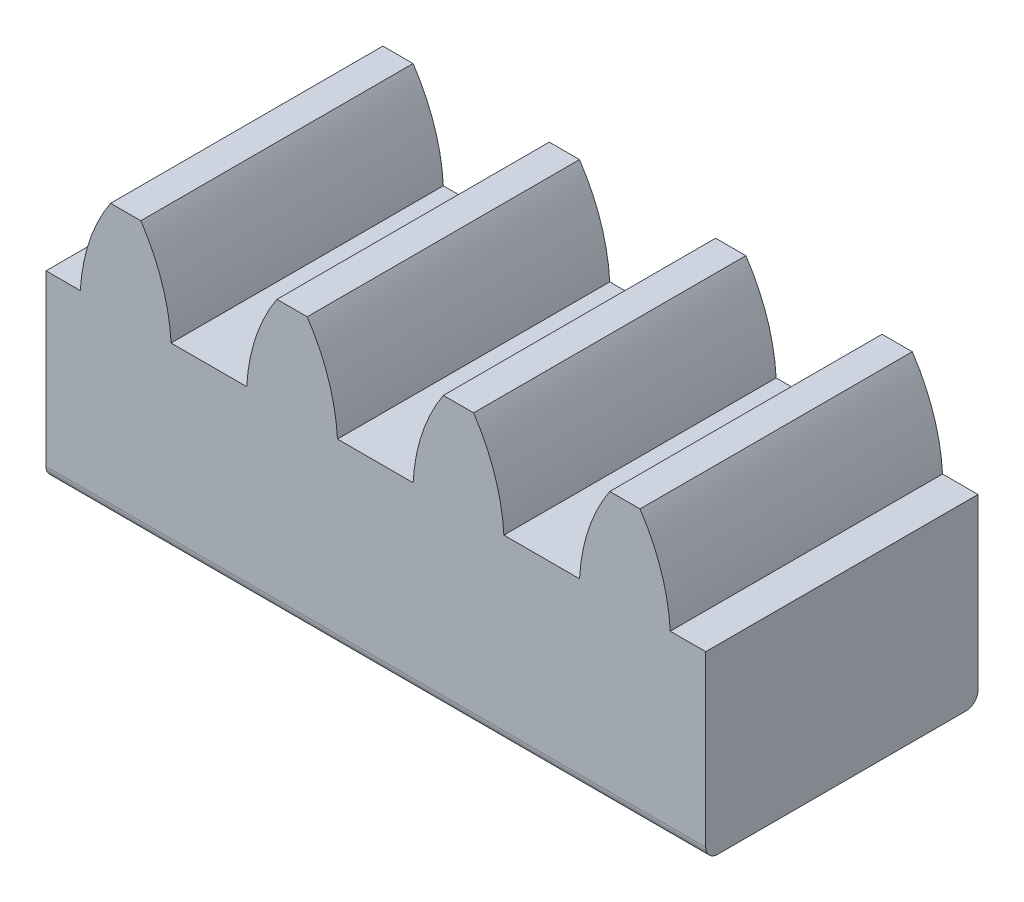
ISO-10303-21;
HEADER;
FILE_DESCRIPTION(('STEP AP214'),'2;1');
FILE_NAME('part.step','',(''),(''),'','','');
FILE_SCHEMA(('AUTOMOTIVE_DESIGN { 1 0 10303 214 1 1 1 1 }'));
ENDSEC;
DATA;
#1=APPLICATION_CONTEXT('core data for automotive mechanical design processes');
#2=APPLICATION_PROTOCOL_DEFINITION('international standard','automotive_design',2000,#1);
#3=PRODUCT_CONTEXT('',#1,'mechanical');
#4=PRODUCT('Part','Part','',(#3));
#5=PRODUCT_RELATED_PRODUCT_CATEGORY('part','',(#4));
#6=PRODUCT_DEFINITION_FORMATION('','',#4);
#7=PRODUCT_DEFINITION_CONTEXT('part definition',#1,'design');
#8=PRODUCT_DEFINITION('design','',#6,#7);
#9=PRODUCT_DEFINITION_SHAPE('','',#8);
#10=(LENGTH_UNIT() NAMED_UNIT(*) SI_UNIT(.MILLI.,.METRE.));
#11=(NAMED_UNIT(*) PLANE_ANGLE_UNIT() SI_UNIT($,.RADIAN.));
#12=(NAMED_UNIT(*) SI_UNIT($,.STERADIAN.) SOLID_ANGLE_UNIT());
#13=UNCERTAINTY_MEASURE_WITH_UNIT(LENGTH_MEASURE(1.E-05),#10,'distance_accuracy_value','');
#14=(GEOMETRIC_REPRESENTATION_CONTEXT(3) GLOBAL_UNCERTAINTY_ASSIGNED_CONTEXT((#13)) GLOBAL_UNIT_ASSIGNED_CONTEXT((#10,
#11,#12)) REPRESENTATION_CONTEXT('',''));
#15=CARTESIAN_POINT('',(0.,0.,0.));
#16=DIRECTION('',(0.,0.,1.));
#17=DIRECTION('',(1.,0.,0.));
#18=AXIS2_PLACEMENT_3D('',#15,#16,#17);
#19=CARTESIAN_POINT('',(-43.831629358462,-35.1596046715852,-13.2426406871193));
#20=DIRECTION('',(0.,0.,1.));
#21=DIRECTION('',(1.,0.,0.));
#22=AXIS2_PLACEMENT_3D('',#19,#20,#21);
#23=CYLINDRICAL_SURFACE('',#22,6.);
#24=CARTESIAN_POINT('',(-43.831629358462,-35.1596046715852,-9.00000000000001));
#25=DIRECTION('',(0.,0.,1.));
#26=DIRECTION('',(1.,0.,0.));
#27=AXIS2_PLACEMENT_3D('',#24,#25,#26);
#28=CIRCLE('',#27,6.);
#29=CARTESIAN_POINT('',(-38.840727793145,-31.8293041498129,-9.00000000000001));
#30=VERTEX_POINT('',#29);
#31=CARTESIAN_POINT('',(-37.840727793145,-34.8293041498129,-9.00000000000001));
#32=VERTEX_POINT('',#31);
#33=EDGE_CURVE('E213',#30,#32,#28,.F.);
#34=ORIENTED_EDGE('',*,*,#33,.F.);
#35=DIRECTION('',(0.,0.,1.));
#36=VECTOR('',#35,1.);
#37=CARTESIAN_POINT('',(-38.840727793145,-31.8293041498129,-13.2426406871193));
#38=LINE('',#37,#36);
#39=CARTESIAN_POINT('',(-38.840727793145,-31.8293041498129,0.));
#40=VERTEX_POINT('',#39);
#41=EDGE_CURVE('E207',#30,#40,#38,.T.);
#42=ORIENTED_EDGE('',*,*,#41,.T.);
#43=CARTESIAN_POINT('',(-43.831629358462,-35.1596046715852,0.));
#44=DIRECTION('',(0.,0.,1.));
#45=DIRECTION('',(1.,0.,0.));
#46=AXIS2_PLACEMENT_3D('',#43,#44,#45);
#47=CIRCLE('',#46,6.);
#48=CARTESIAN_POINT('',(-37.840727793145,-34.8293041498129,0.));
#49=VERTEX_POINT('',#48);
#50=EDGE_CURVE('E211',#49,#40,#47,.T.);
#51=ORIENTED_EDGE('',*,*,#50,.F.);
#52=DIRECTION('',(0.,0.,1.));
#53=VECTOR('',#52,1.);
#54=CARTESIAN_POINT('',(-37.840727793145,-34.8293041498129,-13.2426406871193));
#55=LINE('',#54,#53);
#56=EDGE_CURVE('E379',#32,#49,#55,.T.);
#57=ORIENTED_EDGE('',*,*,#56,.F.);
#58=EDGE_LOOP('',(#34,#42,#51,#57));
#59=FACE_BOUND('',#58,.T.);
#60=ADVANCED_FACE('F57',(#59),#23,.T.);
#61=CARTESIAN_POINT('',(16.5,-31.8293041498129,-13.2426406871193));
#62=DIRECTION('',(0.,-1.,0.));
#63=DIRECTION('',(0.,0.,-1.));
#64=AXIS2_PLACEMENT_3D('',#61,#62,#63);
#65=PLANE('',#64);
#66=ORIENTED_EDGE('',*,*,#41,.F.);
#67=DIRECTION('',(-1.,0.,0.));
#68=VECTOR('',#67,1.);
#69=CARTESIAN_POINT('',(16.5,-31.8293041498129,-9.00000000000001));
#70=LINE('',#69,#68);
#71=CARTESIAN_POINT('',(-39.840727793145,-31.8293041498129,-9.00000000000001));
#72=VERTEX_POINT('',#71);
#73=EDGE_CURVE('E216',#30,#72,#70,.T.);
#74=ORIENTED_EDGE('',*,*,#73,.T.);
#75=DIRECTION('',(0.,0.,1.));
#76=VECTOR('',#75,1.);
#77=CARTESIAN_POINT('',(-39.840727793145,-31.8293041498129,-13.2426406871193));
#78=LINE('',#77,#76);
#79=CARTESIAN_POINT('',(-39.840727793145,-31.8293041498129,0.));
#80=VERTEX_POINT('',#79);
#81=EDGE_CURVE('E222',#72,#80,#78,.T.);
#82=ORIENTED_EDGE('',*,*,#81,.T.);
#83=DIRECTION('',(1.,0.,0.));
#84=VECTOR('',#83,1.);
#85=CARTESIAN_POINT('',(16.5,-31.8293041498129,0.));
#86=LINE('',#85,#84);
#87=EDGE_CURVE('E219',#80,#40,#86,.T.);
#88=ORIENTED_EDGE('',*,*,#87,.T.);
#89=EDGE_LOOP('',(#66,#74,#82,#88));
#90=FACE_BOUND('',#89,.T.);
#91=ADVANCED_FACE('F220',(#90),#65,.F.);
#92=CARTESIAN_POINT('',(-34.8498262278281,-35.1596046715852,-13.2426406871193));
#93=DIRECTION('',(0.,0.,1.));
#94=DIRECTION('',(1.,0.,0.));
#95=AXIS2_PLACEMENT_3D('',#92,#93,#94);
#96=CYLINDRICAL_SURFACE('',#95,6.);
#97=ORIENTED_EDGE('',*,*,#81,.F.);
#98=CARTESIAN_POINT('',(-34.8498262278281,-35.1596046715852,-9.00000000000001));
#99=DIRECTION('',(0.,0.,1.));
#100=DIRECTION('',(1.,0.,0.));
#101=AXIS2_PLACEMENT_3D('',#98,#99,#100);
#102=CIRCLE('',#101,6.);
#103=CARTESIAN_POINT('',(-40.840727793145,-34.8293041498129,-9.00000000000001));
#104=VERTEX_POINT('',#103);
#105=EDGE_CURVE('E226',#72,#104,#102,.T.);
#106=ORIENTED_EDGE('',*,*,#105,.T.);
#107=DIRECTION('',(0.,0.,1.));
#108=VECTOR('',#107,1.);
#109=CARTESIAN_POINT('',(-40.840727793145,-34.8293041498129,-13.2426406871193));
#110=LINE('',#109,#108);
#111=CARTESIAN_POINT('',(-40.840727793145,-34.8293041498129,0.));
#112=VERTEX_POINT('',#111);
#113=EDGE_CURVE('E246',#104,#112,#110,.T.);
#114=ORIENTED_EDGE('',*,*,#113,.T.);
#115=CARTESIAN_POINT('',(-34.8498262278281,-35.1596046715852,0.));
#116=DIRECTION('',(0.,0.,1.));
#117=DIRECTION('',(1.,0.,0.));
#118=AXIS2_PLACEMENT_3D('',#115,#116,#117);
#119=CIRCLE('',#118,6.);
#120=EDGE_CURVE('E383',#112,#80,#119,.F.);
#121=ORIENTED_EDGE('',*,*,#120,.T.);
#122=EDGE_LOOP('',(#97,#106,#114,#121));
#123=FACE_BOUND('',#122,.T.);
#124=ADVANCED_FACE('F411',(#123),#96,.T.);
#125=CARTESIAN_POINT('',(0.,-34.8293041498129,-239.07824755939));
#126=DIRECTION('',(0.,-1.,0.));
#127=DIRECTION('',(0.,0.,-1.));
#128=AXIS2_PLACEMENT_3D('',#125,#126,#127);
#129=PLANE('',#128);
#130=ORIENTED_EDGE('',*,*,#113,.F.);
#131=DIRECTION('',(-1.,0.,0.));
#132=VECTOR('',#131,1.);
#133=CARTESIAN_POINT('',(0.,-34.8293041498129,-9.00000000000001));
#134=LINE('',#133,#132);
#135=CARTESIAN_POINT('',(-43.340727793145,-34.8293041498129,-9.00000000000001));
#136=VERTEX_POINT('',#135);
#137=EDGE_CURVE('E358',#104,#136,#134,.T.);
#138=ORIENTED_EDGE('',*,*,#137,.T.);
#139=DIRECTION('',(0.,0.,1.));
#140=VECTOR('',#139,1.);
#141=CARTESIAN_POINT('',(-43.340727793145,-34.8293041498129,-13.2426406871193));
#142=LINE('',#141,#140);
#143=CARTESIAN_POINT('',(-43.340727793145,-34.8293041498129,0.));
#144=VERTEX_POINT('',#143);
#145=EDGE_CURVE('E355',#136,#144,#142,.T.);
#146=ORIENTED_EDGE('',*,*,#145,.T.);
#147=DIRECTION('',(1.,0.,0.));
#148=VECTOR('',#147,1.);
#149=CARTESIAN_POINT('',(0.,-34.8293041498129,0.));
#150=LINE('',#149,#148);
#151=EDGE_CURVE('E357',#144,#112,#150,.T.);
#152=ORIENTED_EDGE('',*,*,#151,.T.);
#153=EDGE_LOOP('',(#130,#138,#146,#152));
#154=FACE_BOUND('',#153,.T.);
#155=ADVANCED_FACE('F430',(#154),#129,.F.);
#156=CARTESIAN_POINT('',(-49.331629358462,-35.1596046715852,-13.2426406871193));
#157=DIRECTION('',(0.,0.,1.));
#158=DIRECTION('',(1.,0.,0.));
#159=AXIS2_PLACEMENT_3D('',#156,#157,#158);
#160=CYLINDRICAL_SURFACE('',#159,6.);
#161=CARTESIAN_POINT('',(-49.331629358462,-35.1596046715852,-9.00000000000001));
#162=DIRECTION('',(0.,0.,1.));
#163=DIRECTION('',(1.,0.,0.));
#164=AXIS2_PLACEMENT_3D('',#161,#162,#163);
#165=CIRCLE('',#164,6.);
#166=CARTESIAN_POINT('',(-44.340727793145,-31.8293041498129,-9.00000000000001));
#167=VERTEX_POINT('',#166);
#168=EDGE_CURVE('E327',#167,#136,#165,.F.);
#169=ORIENTED_EDGE('',*,*,#168,.F.);
#170=DIRECTION('',(0.,0.,1.));
#171=VECTOR('',#170,1.);
#172=CARTESIAN_POINT('',(-44.340727793145,-31.8293041498129,-13.2426406871193));
#173=LINE('',#172,#171);
#174=CARTESIAN_POINT('',(-44.340727793145,-31.8293041498129,0.));
#175=VERTEX_POINT('',#174);
#176=EDGE_CURVE('E359',#167,#175,#173,.T.);
#177=ORIENTED_EDGE('',*,*,#176,.T.);
#178=CARTESIAN_POINT('',(-49.331629358462,-35.1596046715852,0.));
#179=DIRECTION('',(0.,0.,1.));
#180=DIRECTION('',(1.,0.,0.));
#181=AXIS2_PLACEMENT_3D('',#178,#179,#180);
#182=CIRCLE('',#181,6.);
#183=EDGE_CURVE('E234',#144,#175,#182,.T.);
#184=ORIENTED_EDGE('',*,*,#183,.F.);
#185=ORIENTED_EDGE('',*,*,#145,.F.);
#186=EDGE_LOOP('',(#169,#177,#184,#185));
#187=FACE_BOUND('',#186,.T.);
#188=ADVANCED_FACE('F417',(#187),#160,.T.);
#189=CARTESIAN_POINT('',(11.,-31.8293041498129,-13.2426406871193));
#190=DIRECTION('',(0.,-1.,0.));
#191=DIRECTION('',(0.,0.,-1.));
#192=AXIS2_PLACEMENT_3D('',#189,#190,#191);
#193=PLANE('',#192);
#194=ORIENTED_EDGE('',*,*,#176,.F.);
#195=DIRECTION('',(-1.,0.,0.));
#196=VECTOR('',#195,1.);
#197=CARTESIAN_POINT('',(11.,-31.8293041498129,-9.00000000000001));
#198=LINE('',#197,#196);
#199=CARTESIAN_POINT('',(-45.340727793145,-31.8293041498129,-9.00000000000001));
#200=VERTEX_POINT('',#199);
#201=EDGE_CURVE('E361',#167,#200,#198,.T.);
#202=ORIENTED_EDGE('',*,*,#201,.T.);
#203=DIRECTION('',(0.,0.,1.));
#204=VECTOR('',#203,1.);
#205=CARTESIAN_POINT('',(-45.340727793145,-31.8293041498129,-13.2426406871193));
#206=LINE('',#205,#204);
#207=CARTESIAN_POINT('',(-45.340727793145,-31.8293041498129,0.));
#208=VERTEX_POINT('',#207);
#209=EDGE_CURVE('E362',#200,#208,#206,.T.);
#210=ORIENTED_EDGE('',*,*,#209,.T.);
#211=DIRECTION('',(1.,0.,0.));
#212=VECTOR('',#211,1.);
#213=CARTESIAN_POINT('',(11.,-31.8293041498129,0.));
#214=LINE('',#213,#212);
#215=EDGE_CURVE('E364',#208,#175,#214,.T.);
#216=ORIENTED_EDGE('',*,*,#215,.T.);
#217=EDGE_LOOP('',(#194,#202,#210,#216));
#218=FACE_BOUND('',#217,.T.);
#219=ADVANCED_FACE('F420',(#218),#193,.F.);
#220=CARTESIAN_POINT('',(-40.3498262278281,-35.1596046715852,-13.2426406871193));
#221=DIRECTION('',(0.,0.,1.));
#222=DIRECTION('',(1.,0.,0.));
#223=AXIS2_PLACEMENT_3D('',#220,#221,#222);
#224=CYLINDRICAL_SURFACE('',#223,6.);
#225=ORIENTED_EDGE('',*,*,#209,.F.);
#226=CARTESIAN_POINT('',(-40.3498262278281,-35.1596046715852,-9.00000000000001));
#227=DIRECTION('',(0.,0.,1.));
#228=DIRECTION('',(1.,0.,0.));
#229=AXIS2_PLACEMENT_3D('',#226,#227,#228);
#230=CIRCLE('',#229,6.);
#231=CARTESIAN_POINT('',(-46.340727793145,-34.8293041498129,-9.00000000000001));
#232=VERTEX_POINT('',#231);
#233=EDGE_CURVE('E369',#200,#232,#230,.T.);
#234=ORIENTED_EDGE('',*,*,#233,.T.);
#235=DIRECTION('',(0.,0.,1.));
#236=VECTOR('',#235,1.);
#237=CARTESIAN_POINT('',(-46.340727793145,-34.8293041498129,-13.2426406871193));
#238=LINE('',#237,#236);
#239=CARTESIAN_POINT('',(-46.340727793145,-34.8293041498129,0.));
#240=VERTEX_POINT('',#239);
#241=EDGE_CURVE('E365',#232,#240,#238,.T.);
#242=ORIENTED_EDGE('',*,*,#241,.T.);
#243=CARTESIAN_POINT('',(-40.3498262278281,-35.1596046715852,0.));
#244=DIRECTION('',(0.,0.,1.));
#245=DIRECTION('',(1.,0.,0.));
#246=AXIS2_PLACEMENT_3D('',#243,#244,#245);
#247=CIRCLE('',#246,6.);
#248=EDGE_CURVE('E368',#240,#208,#247,.F.);
#249=ORIENTED_EDGE('',*,*,#248,.T.);
#250=EDGE_LOOP('',(#225,#234,#242,#249));
#251=FACE_BOUND('',#250,.T.);
#252=ADVANCED_FACE('F425',(#251),#224,.T.);
#253=ORIENTED_EDGE('',*,*,#241,.F.);
#254=CARTESIAN_POINT('',(-48.840727793145,-34.8293041498129,-9.00000000000001));
#255=VERTEX_POINT('',#254);
#256=EDGE_CURVE('E331',#232,#255,#134,.T.);
#257=ORIENTED_EDGE('',*,*,#256,.T.);
#258=DIRECTION('',(0.,0.,1.));
#259=VECTOR('',#258,1.);
#260=CARTESIAN_POINT('',(-48.840727793145,-34.8293041498129,-13.2426406871193));
#261=LINE('',#260,#259);
#262=CARTESIAN_POINT('',(-48.840727793145,-34.8293041498129,0.));
#263=VERTEX_POINT('',#262);
#264=EDGE_CURVE('E328',#255,#263,#261,.T.);
#265=ORIENTED_EDGE('',*,*,#264,.T.);
#266=EDGE_CURVE('E330',#263,#240,#150,.T.);
#267=ORIENTED_EDGE('',*,*,#266,.T.);
#268=EDGE_LOOP('',(#253,#257,#265,#267));
#269=FACE_BOUND('',#268,.T.);
#270=ADVANCED_FACE('F426',(#269),#129,.F.);
#271=CARTESIAN_POINT('',(-54.831629358462,-35.1596046715852,-13.2426406871193));
#272=DIRECTION('',(0.,0.,1.));
#273=DIRECTION('',(1.,0.,0.));
#274=AXIS2_PLACEMENT_3D('',#271,#272,#273);
#275=CYLINDRICAL_SURFACE('',#274,6.);
#276=CARTESIAN_POINT('',(-54.831629358462,-35.1596046715852,-9.00000000000001));
#277=DIRECTION('',(0.,0.,1.));
#278=DIRECTION('',(1.,0.,0.));
#279=AXIS2_PLACEMENT_3D('',#276,#277,#278);
#280=CIRCLE('',#279,6.);
#281=CARTESIAN_POINT('',(-49.840727793145,-31.8293041498129,-9.00000000000001));
#282=VERTEX_POINT('',#281);
#283=EDGE_CURVE('E298',#282,#255,#280,.F.);
#284=ORIENTED_EDGE('',*,*,#283,.F.);
#285=DIRECTION('',(0.,0.,1.));
#286=VECTOR('',#285,1.);
#287=CARTESIAN_POINT('',(-49.840727793145,-31.8293041498129,-13.2426406871193));
#288=LINE('',#287,#286);
#289=CARTESIAN_POINT('',(-49.840727793145,-31.8293041498129,0.));
#290=VERTEX_POINT('',#289);
#291=EDGE_CURVE('E332',#282,#290,#288,.T.);
#292=ORIENTED_EDGE('',*,*,#291,.T.);
#293=CARTESIAN_POINT('',(-54.831629358462,-35.1596046715852,0.));
#294=DIRECTION('',(0.,0.,1.));
#295=DIRECTION('',(1.,0.,0.));
#296=AXIS2_PLACEMENT_3D('',#293,#294,#295);
#297=CIRCLE('',#296,6.);
#298=EDGE_CURVE('E238',#263,#290,#297,.T.);
#299=ORIENTED_EDGE('',*,*,#298,.F.);
#300=ORIENTED_EDGE('',*,*,#264,.F.);
#301=EDGE_LOOP('',(#284,#292,#299,#300));
#302=FACE_BOUND('',#301,.T.);
#303=ADVANCED_FACE('F428',(#302),#275,.T.);
#304=CARTESIAN_POINT('',(5.5,-31.8293041498129,-13.2426406871193));
#305=DIRECTION('',(0.,-1.,0.));
#306=DIRECTION('',(0.,0.,-1.));
#307=AXIS2_PLACEMENT_3D('',#304,#305,#306);
#308=PLANE('',#307);
#309=ORIENTED_EDGE('',*,*,#291,.F.);
#310=DIRECTION('',(-1.,0.,0.));
#311=VECTOR('',#310,1.);
#312=CARTESIAN_POINT('',(5.5,-31.8293041498129,-9.00000000000001));
#313=LINE('',#312,#311);
#314=CARTESIAN_POINT('',(-50.840727793145,-31.8293041498129,-9.00000000000001));
#315=VERTEX_POINT('',#314);
#316=EDGE_CURVE('E334',#282,#315,#313,.T.);
#317=ORIENTED_EDGE('',*,*,#316,.T.);
#318=DIRECTION('',(0.,0.,1.));
#319=VECTOR('',#318,1.);
#320=CARTESIAN_POINT('',(-50.840727793145,-31.8293041498129,-13.2426406871193));
#321=LINE('',#320,#319);
#322=CARTESIAN_POINT('',(-50.840727793145,-31.8293041498129,0.));
#323=VERTEX_POINT('',#322);
#324=EDGE_CURVE('E335',#315,#323,#321,.T.);
#325=ORIENTED_EDGE('',*,*,#324,.T.);
#326=DIRECTION('',(1.,0.,0.));
#327=VECTOR('',#326,1.);
#328=CARTESIAN_POINT('',(5.5,-31.8293041498129,0.));
#329=LINE('',#328,#327);
#330=EDGE_CURVE('E337',#323,#290,#329,.T.);
#331=ORIENTED_EDGE('',*,*,#330,.T.);
#332=EDGE_LOOP('',(#309,#317,#325,#331));
#333=FACE_BOUND('',#332,.T.);
#334=ADVANCED_FACE('F435',(#333),#308,.F.);
#335=CARTESIAN_POINT('',(-45.8498262278281,-35.1596046715852,-13.2426406871193));
#336=DIRECTION('',(0.,0.,1.));
#337=DIRECTION('',(1.,0.,0.));
#338=AXIS2_PLACEMENT_3D('',#335,#336,#337);
#339=CYLINDRICAL_SURFACE('',#338,6.);
#340=ORIENTED_EDGE('',*,*,#324,.F.);
#341=CARTESIAN_POINT('',(-45.8498262278281,-35.1596046715852,-9.00000000000001));
#342=DIRECTION('',(0.,0.,1.));
#343=DIRECTION('',(1.,0.,0.));
#344=AXIS2_PLACEMENT_3D('',#341,#342,#343);
#345=CIRCLE('',#344,6.);
#346=CARTESIAN_POINT('',(-51.840727793145,-34.8293041498129,-9.00000000000001));
#347=VERTEX_POINT('',#346);
#348=EDGE_CURVE('E342',#315,#347,#345,.T.);
#349=ORIENTED_EDGE('',*,*,#348,.T.);
#350=DIRECTION('',(0.,0.,1.));
#351=VECTOR('',#350,1.);
#352=CARTESIAN_POINT('',(-51.840727793145,-34.8293041498129,-13.2426406871193));
#353=LINE('',#352,#351);
#354=CARTESIAN_POINT('',(-51.840727793145,-34.8293041498129,0.));
#355=VERTEX_POINT('',#354);
#356=EDGE_CURVE('E338',#347,#355,#353,.T.);
#357=ORIENTED_EDGE('',*,*,#356,.T.);
#358=CARTESIAN_POINT('',(-45.8498262278281,-35.1596046715852,0.));
#359=DIRECTION('',(0.,0.,1.));
#360=DIRECTION('',(1.,0.,0.));
#361=AXIS2_PLACEMENT_3D('',#358,#359,#360);
#362=CIRCLE('',#361,6.);
#363=EDGE_CURVE('E341',#355,#323,#362,.F.);
#364=ORIENTED_EDGE('',*,*,#363,.T.);
#365=EDGE_LOOP('',(#340,#349,#357,#364));
#366=FACE_BOUND('',#365,.T.);
#367=ADVANCED_FACE('F444',(#366),#339,.T.);
#368=ORIENTED_EDGE('',*,*,#356,.F.);
#369=CARTESIAN_POINT('',(-54.340727793145,-34.8293041498129,-9.00000000000001));
#370=VERTEX_POINT('',#369);
#371=EDGE_CURVE('E272',#347,#370,#134,.T.);
#372=ORIENTED_EDGE('',*,*,#371,.T.);
#373=DIRECTION('',(0.,0.,1.));
#374=VECTOR('',#373,1.);
#375=CARTESIAN_POINT('',(-54.340727793145,-34.8293041498129,-13.2426406871193));
#376=LINE('',#375,#374);
#377=CARTESIAN_POINT('',(-54.340727793145,-34.8293041498129,0.));
#378=VERTEX_POINT('',#377);
#379=EDGE_CURVE('E303',#370,#378,#376,.T.);
#380=ORIENTED_EDGE('',*,*,#379,.T.);
#381=EDGE_CURVE('E268',#378,#355,#150,.T.);
#382=ORIENTED_EDGE('',*,*,#381,.T.);
#383=EDGE_LOOP('',(#368,#372,#380,#382));
#384=FACE_BOUND('',#383,.T.);
#385=ADVANCED_FACE('F391',(#384),#129,.F.);
#386=CARTESIAN_POINT('',(-60.331629358462,-35.1596046715852,-13.2426406871193));
#387=DIRECTION('',(0.,0.,1.));
#388=DIRECTION('',(1.,0.,0.));
#389=AXIS2_PLACEMENT_3D('',#386,#387,#388);
#390=CYLINDRICAL_SURFACE('',#389,6.);
#391=CARTESIAN_POINT('',(-60.331629358462,-35.1596046715852,-9.00000000000001));
#392=DIRECTION('',(0.,0.,1.));
#393=DIRECTION('',(1.,0.,0.));
#394=AXIS2_PLACEMENT_3D('',#391,#392,#393);
#395=CIRCLE('',#394,6.);
#396=CARTESIAN_POINT('',(-55.340727793145,-31.8293041498129,-9.00000000000001));
#397=VERTEX_POINT('',#396);
#398=EDGE_CURVE('E295',#397,#370,#395,.F.);
#399=ORIENTED_EDGE('',*,*,#398,.F.);
#400=DIRECTION('',(0.,0.,1.));
#401=VECTOR('',#400,1.);
#402=CARTESIAN_POINT('',(-55.340727793145,-31.8293041498129,-13.2426406871193));
#403=LINE('',#402,#401);
#404=CARTESIAN_POINT('',(-55.340727793145,-31.8293041498129,0.));
#405=VERTEX_POINT('',#404);
#406=EDGE_CURVE('E305',#397,#405,#403,.T.);
#407=ORIENTED_EDGE('',*,*,#406,.T.);
#408=CARTESIAN_POINT('',(-60.331629358462,-35.1596046715852,0.));
#409=DIRECTION('',(0.,0.,1.));
#410=DIRECTION('',(1.,0.,0.));
#411=AXIS2_PLACEMENT_3D('',#408,#409,#410);
#412=CIRCLE('',#411,6.);
#413=EDGE_CURVE('E277',#378,#405,#412,.T.);
#414=ORIENTED_EDGE('',*,*,#413,.F.);
#415=ORIENTED_EDGE('',*,*,#379,.F.);
#416=EDGE_LOOP('',(#399,#407,#414,#415));
#417=FACE_BOUND('',#416,.T.);
#418=ADVANCED_FACE('F400',(#417),#390,.T.);
#419=CARTESIAN_POINT('',(0.,-31.8293041498129,-13.2426406871193));
#420=DIRECTION('',(0.,-1.,0.));
#421=DIRECTION('',(0.,0.,-1.));
#422=AXIS2_PLACEMENT_3D('',#419,#420,#421);
#423=PLANE('',#422);
#424=ORIENTED_EDGE('',*,*,#406,.F.);
#425=DIRECTION('',(-1.,0.,0.));
#426=VECTOR('',#425,1.);
#427=CARTESIAN_POINT('',(0.,-31.8293041498129,-9.00000000000001));
#428=LINE('',#427,#426);
#429=CARTESIAN_POINT('',(-56.340727793145,-31.8293041498129,-9.00000000000001));
#430=VERTEX_POINT('',#429);
#431=EDGE_CURVE('E307',#397,#430,#428,.T.);
#432=ORIENTED_EDGE('',*,*,#431,.T.);
#433=DIRECTION('',(0.,0.,1.));
#434=VECTOR('',#433,1.);
#435=CARTESIAN_POINT('',(-56.340727793145,-31.8293041498129,-13.2426406871193));
#436=LINE('',#435,#434);
#437=CARTESIAN_POINT('',(-56.340727793145,-31.8293041498129,0.));
#438=VERTEX_POINT('',#437);
#439=EDGE_CURVE('E308',#430,#438,#436,.T.);
#440=ORIENTED_EDGE('',*,*,#439,.T.);
#441=DIRECTION('',(1.,0.,0.));
#442=VECTOR('',#441,1.);
#443=CARTESIAN_POINT('',(0.,-31.8293041498129,0.));
#444=LINE('',#443,#442);
#445=EDGE_CURVE('E310',#438,#405,#444,.T.);
#446=ORIENTED_EDGE('',*,*,#445,.T.);
#447=EDGE_LOOP('',(#424,#432,#440,#446));
#448=FACE_BOUND('',#447,.T.);
#449=ADVANCED_FACE('F474',(#448),#423,.F.);
#450=CARTESIAN_POINT('',(-51.3498262278281,-35.1596046715852,-13.2426406871193));
#451=DIRECTION('',(0.,0.,1.));
#452=DIRECTION('',(1.,0.,0.));
#453=AXIS2_PLACEMENT_3D('',#450,#451,#452);
#454=CYLINDRICAL_SURFACE('',#453,6.);
#455=ORIENTED_EDGE('',*,*,#439,.F.);
#456=CARTESIAN_POINT('',(-51.3498262278281,-35.1596046715852,-9.00000000000001));
#457=DIRECTION('',(0.,0.,1.));
#458=DIRECTION('',(1.,0.,0.));
#459=AXIS2_PLACEMENT_3D('',#456,#457,#458);
#460=CIRCLE('',#459,6.);
#461=CARTESIAN_POINT('',(-57.340727793145,-34.8293041498129,-9.00000000000001));
#462=VERTEX_POINT('',#461);
#463=EDGE_CURVE('E314',#430,#462,#460,.T.);
#464=ORIENTED_EDGE('',*,*,#463,.T.);
#465=DIRECTION('',(0.,0.,1.));
#466=VECTOR('',#465,1.);
#467=CARTESIAN_POINT('',(-57.340727793145,-34.8293041498129,-13.2426406871193));
#468=LINE('',#467,#466);
#469=CARTESIAN_POINT('',(-57.340727793145,-34.8293041498129,0.));
#470=VERTEX_POINT('',#469);
#471=EDGE_CURVE('E311',#462,#470,#468,.T.);
#472=ORIENTED_EDGE('',*,*,#471,.T.);
#473=CARTESIAN_POINT('',(-51.3498262278281,-35.1596046715852,0.));
#474=DIRECTION('',(0.,0.,1.));
#475=DIRECTION('',(1.,0.,0.));
#476=AXIS2_PLACEMENT_3D('',#473,#474,#475);
#477=CIRCLE('',#476,6.);
#478=EDGE_CURVE('E300',#470,#438,#477,.F.);
#479=ORIENTED_EDGE('',*,*,#478,.T.);
#480=EDGE_LOOP('',(#455,#464,#472,#479));
#481=FACE_BOUND('',#480,.T.);
#482=ADVANCED_FACE('F472',(#481),#454,.T.);
#483=CARTESIAN_POINT('',(0.,-40.4293041498129,-8.6));
#484=DIRECTION('',(1.,0.,0.));
#485=DIRECTION('',(0.,1.,0.));
#486=AXIS2_PLACEMENT_3D('',#483,#484,#485);
#487=CYLINDRICAL_SURFACE('',#486,0.4);
#488=DIRECTION('',(-1.,0.,0.));
#489=VECTOR('',#488,1.);
#490=CARTESIAN_POINT('',(169.30734265601,-40.8293041498129,-8.6));
#491=LINE('',#490,#489);
#492=CARTESIAN_POINT('',(-58.4752036518033,-40.8293041498129,-8.6));
#493=VERTEX_POINT('',#492);
#494=CARTESIAN_POINT('',(-36.6682723425899,-40.8293041498129,-8.6));
#495=VERTEX_POINT('',#494);
#496=EDGE_CURVE('E263',#493,#495,#491,.F.);
#497=ORIENTED_EDGE('',*,*,#496,.F.);
#498=CARTESIAN_POINT('',(-58.4752036518033,-40.4293041498129,-8.6));
#499=DIRECTION('',(-1.,0.,0.));
#500=DIRECTION('',(0.,0.,1.));
#501=AXIS2_PLACEMENT_3D('',#498,#499,#500);
#502=CIRCLE('',#501,0.4);
#503=CARTESIAN_POINT('',(-58.4752036518033,-40.4293041498129,-9.00000000000001));
#504=VERTEX_POINT('',#503);
#505=EDGE_CURVE('E101',#493,#504,#502,.F.);
#506=ORIENTED_EDGE('',*,*,#505,.T.);
#507=DIRECTION('',(-1.,0.,0.));
#508=VECTOR('',#507,1.);
#509=CARTESIAN_POINT('',(-60.69265734399,-40.4293041498129,-9.00000000000001));
#510=LINE('',#509,#508);
#511=CARTESIAN_POINT('',(-36.6682723425899,-40.4293041498129,-9.00000000000001));
#512=VERTEX_POINT('',#511);
#513=EDGE_CURVE('E61',#512,#504,#510,.T.);
#514=ORIENTED_EDGE('',*,*,#513,.F.);
#515=CARTESIAN_POINT('',(-36.6682723425899,-40.4293041498129,-8.6));
#516=DIRECTION('',(1.,0.,0.));
#517=DIRECTION('',(0.,0.,-1.));
#518=AXIS2_PLACEMENT_3D('',#515,#516,#517);
#519=CIRCLE('',#518,0.4);
#520=EDGE_CURVE('E293',#512,#495,#519,.F.);
#521=ORIENTED_EDGE('',*,*,#520,.T.);
#522=EDGE_LOOP('',(#497,#506,#514,#521));
#523=FACE_BOUND('',#522,.T.);
#524=ADVANCED_FACE('F290',(#523),#487,.T.);
#525=CARTESIAN_POINT('',(0.,2.00000000000006,-9.00000000000001));
#526=DIRECTION('',(0.,0.,1.));
#527=DIRECTION('',(1.,0.,0.));
#528=AXIS2_PLACEMENT_3D('',#525,#526,#527);
#529=PLANE('',#528);
#530=DIRECTION('',(0.,-1.,0.));
#531=VECTOR('',#530,1.);
#532=CARTESIAN_POINT('',(-58.4752036518033,2.00000000000006,-9.00000000000001));
#533=LINE('',#532,#531);
#534=CARTESIAN_POINT('',(-58.4752036518033,-34.8293041498129,-9.00000000000001));
#535=VERTEX_POINT('',#534);
#536=EDGE_CURVE('E67',#535,#504,#533,.T.);
#537=ORIENTED_EDGE('',*,*,#536,.F.);
#538=EDGE_CURVE('E267',#462,#535,#134,.T.);
#539=ORIENTED_EDGE('',*,*,#538,.F.);
#540=ORIENTED_EDGE('',*,*,#463,.F.);
#541=ORIENTED_EDGE('',*,*,#431,.F.);
#542=ORIENTED_EDGE('',*,*,#398,.T.);
#543=ORIENTED_EDGE('',*,*,#371,.F.);
#544=ORIENTED_EDGE('',*,*,#348,.F.);
#545=ORIENTED_EDGE('',*,*,#316,.F.);
#546=ORIENTED_EDGE('',*,*,#283,.T.);
#547=ORIENTED_EDGE('',*,*,#256,.F.);
#548=ORIENTED_EDGE('',*,*,#233,.F.);
#549=ORIENTED_EDGE('',*,*,#201,.F.);
#550=ORIENTED_EDGE('',*,*,#168,.T.);
#551=ORIENTED_EDGE('',*,*,#137,.F.);
#552=ORIENTED_EDGE('',*,*,#105,.F.);
#553=ORIENTED_EDGE('',*,*,#73,.F.);
#554=ORIENTED_EDGE('',*,*,#33,.T.);
#555=CARTESIAN_POINT('',(-36.6682723425899,-34.8293041498129,-9.00000000000001));
#556=VERTEX_POINT('',#555);
#557=EDGE_CURVE('E271',#556,#32,#134,.T.);
#558=ORIENTED_EDGE('',*,*,#557,.F.);
#559=DIRECTION('',(0.,1.,0.));
#560=VECTOR('',#559,1.);
#561=CARTESIAN_POINT('',(-36.6682723425899,2.00000000000006,-9.00000000000001));
#562=LINE('',#561,#560);
#563=EDGE_CURVE('E258',#512,#556,#562,.T.);
#564=ORIENTED_EDGE('',*,*,#563,.F.);
#565=ORIENTED_EDGE('',*,*,#513,.T.);
#566=EDGE_LOOP('',(#537,#539,#540,#541,#542,#543,#544,#545,#546,#547,#548,#549,#550,#551,#552,
#553,#554,#558,#564,#565));
#567=FACE_BOUND('',#566,.T.);
#568=ADVANCED_FACE('F396',(#567),#529,.F.);
#569=CARTESIAN_POINT('',(0.,-40.4293041498129,-0.4));
#570=DIRECTION('',(1.,0.,0.));
#571=DIRECTION('',(0.,1.,0.));
#572=AXIS2_PLACEMENT_3D('',#569,#570,#571);
#573=CYLINDRICAL_SURFACE('',#572,0.4);
#574=DIRECTION('',(1.,0.,0.));
#575=VECTOR('',#574,1.);
#576=CARTESIAN_POINT('',(0.,-40.4293041498129,0.));
#577=LINE('',#576,#575);
#578=CARTESIAN_POINT('',(-58.4752036518033,-40.4293041498129,0.));
#579=VERTEX_POINT('',#578);
#580=CARTESIAN_POINT('',(-36.6682723425899,-40.4293041498129,0.));
#581=VERTEX_POINT('',#580);
#582=EDGE_CURVE('E240',#579,#581,#577,.T.);
#583=ORIENTED_EDGE('',*,*,#582,.F.);
#584=CARTESIAN_POINT('',(-58.4752036518033,-40.4293041498129,-0.4));
#585=DIRECTION('',(-1.,0.,0.));
#586=DIRECTION('',(0.,0.,1.));
#587=AXIS2_PLACEMENT_3D('',#584,#585,#586);
#588=CIRCLE('',#587,0.4);
#589=CARTESIAN_POINT('',(-58.4752036518033,-40.8293041498129,-0.399999999999999));
#590=VERTEX_POINT('',#589);
#591=EDGE_CURVE('E75',#579,#590,#588,.F.);
#592=ORIENTED_EDGE('',*,*,#591,.T.);
#593=DIRECTION('',(1.,0.,0.));
#594=VECTOR('',#593,1.);
#595=CARTESIAN_POINT('',(0.,-40.8293041498129,-0.400000000000011));
#596=LINE('',#595,#594);
#597=CARTESIAN_POINT('',(-36.6682723425899,-40.8293041498129,-0.399999999999999));
#598=VERTEX_POINT('',#597);
#599=EDGE_CURVE('E275',#598,#590,#596,.F.);
#600=ORIENTED_EDGE('',*,*,#599,.F.);
#601=CARTESIAN_POINT('',(-36.6682723425899,-40.4293041498129,-0.4));
#602=DIRECTION('',(1.,0.,0.));
#603=DIRECTION('',(0.,0.,-1.));
#604=AXIS2_PLACEMENT_3D('',#601,#602,#603);
#605=CIRCLE('',#604,0.4);
#606=EDGE_CURVE('E249',#598,#581,#605,.F.);
#607=ORIENTED_EDGE('',*,*,#606,.T.);
#608=EDGE_LOOP('',(#583,#592,#600,#607));
#609=FACE_BOUND('',#608,.T.);
#610=ADVANCED_FACE('F281',(#609),#573,.T.);
#611=CARTESIAN_POINT('',(0.,0.,0.));
#612=DIRECTION('',(0.,0.,1.));
#613=DIRECTION('',(1.,0.,0.));
#614=AXIS2_PLACEMENT_3D('',#611,#612,#613);
#615=PLANE('',#614);
#616=CARTESIAN_POINT('',(-58.4752036518033,-34.8293041498129,0.));
#617=VERTEX_POINT('',#616);
#618=EDGE_CURVE('E262',#617,#470,#150,.T.);
#619=ORIENTED_EDGE('',*,*,#618,.F.);
#620=DIRECTION('',(0.,-1.,0.));
#621=VECTOR('',#620,1.);
#622=CARTESIAN_POINT('',(-58.4752036518033,-40.8293041498129,0.));
#623=LINE('',#622,#621);
#624=EDGE_CURVE('E256',#617,#579,#623,.T.);
#625=ORIENTED_EDGE('',*,*,#624,.T.);
#626=ORIENTED_EDGE('',*,*,#582,.T.);
#627=DIRECTION('',(0.,1.,0.));
#628=VECTOR('',#627,1.);
#629=CARTESIAN_POINT('',(-36.6682723425899,-40.8293041498129,0.));
#630=LINE('',#629,#628);
#631=CARTESIAN_POINT('',(-36.6682723425899,-34.8293041498129,0.));
#632=VERTEX_POINT('',#631);
#633=EDGE_CURVE('E235',#581,#632,#630,.T.);
#634=ORIENTED_EDGE('',*,*,#633,.T.);
#635=EDGE_CURVE('E233',#49,#632,#150,.T.);
#636=ORIENTED_EDGE('',*,*,#635,.F.);
#637=ORIENTED_EDGE('',*,*,#50,.T.);
#638=ORIENTED_EDGE('',*,*,#87,.F.);
#639=ORIENTED_EDGE('',*,*,#120,.F.);
#640=ORIENTED_EDGE('',*,*,#151,.F.);
#641=ORIENTED_EDGE('',*,*,#183,.T.);
#642=ORIENTED_EDGE('',*,*,#215,.F.);
#643=ORIENTED_EDGE('',*,*,#248,.F.);
#644=ORIENTED_EDGE('',*,*,#266,.F.);
#645=ORIENTED_EDGE('',*,*,#298,.T.);
#646=ORIENTED_EDGE('',*,*,#330,.F.);
#647=ORIENTED_EDGE('',*,*,#363,.F.);
#648=ORIENTED_EDGE('',*,*,#381,.F.);
#649=ORIENTED_EDGE('',*,*,#413,.T.);
#650=ORIENTED_EDGE('',*,*,#445,.F.);
#651=ORIENTED_EDGE('',*,*,#478,.F.);
#652=EDGE_LOOP('',(#619,#625,#626,#634,#636,#637,#638,#639,#640,#641,#642,#643,#644,#645,#646,
#647,#648,#649,#650,#651));
#653=FACE_BOUND('',#652,.T.);
#654=ADVANCED_FACE('F230',(#653),#615,.T.);
#655=CARTESIAN_POINT('',(0.,-40.8293041498129,-239.07824755939));
#656=DIRECTION('',(0.,-1.,0.));
#657=DIRECTION('',(1.,0.,0.));
#658=AXIS2_PLACEMENT_3D('',#655,#656,#657);
#659=PLANE('',#658);
#660=ORIENTED_EDGE('',*,*,#599,.T.);
#661=DIRECTION('',(0.,0.,1.));
#662=VECTOR('',#661,1.);
#663=CARTESIAN_POINT('',(-58.4752036518033,-40.8293041498129,-14.5));
#664=LINE('',#663,#662);
#665=EDGE_CURVE('E12',#493,#590,#664,.T.);
#666=ORIENTED_EDGE('',*,*,#665,.F.);
#667=ORIENTED_EDGE('',*,*,#496,.T.);
#668=DIRECTION('',(0.,0.,1.));
#669=VECTOR('',#668,1.);
#670=CARTESIAN_POINT('',(-36.6682723425899,-40.8293041498129,-14.5));
#671=LINE('',#670,#669);
#672=EDGE_CURVE('E260',#495,#598,#671,.T.);
#673=ORIENTED_EDGE('',*,*,#672,.T.);
#674=EDGE_LOOP('',(#660,#666,#667,#673));
#675=FACE_BOUND('',#674,.T.);
#676=ADVANCED_FACE('F59',(#675),#659,.T.);
#677=DIRECTION('',(0.,0.,-1.));
#678=VECTOR('',#677,1.);
#679=CARTESIAN_POINT('',(-58.4752036518033,-34.8293041498129,-239.07824755939));
#680=LINE('',#679,#678);
#681=EDGE_CURVE('E250',#617,#535,#680,.T.);
#682=ORIENTED_EDGE('',*,*,#681,.F.);
#683=ORIENTED_EDGE('',*,*,#618,.T.);
#684=ORIENTED_EDGE('',*,*,#471,.F.);
#685=ORIENTED_EDGE('',*,*,#538,.T.);
#686=EDGE_LOOP('',(#682,#683,#684,#685));
#687=FACE_BOUND('',#686,.T.);
#688=ADVANCED_FACE('F442',(#687),#129,.F.);
#689=DIRECTION('',(0.,0.,1.));
#690=VECTOR('',#689,1.);
#691=CARTESIAN_POINT('',(-36.6682723425899,-34.8293041498129,-239.07824755939));
#692=LINE('',#691,#690);
#693=EDGE_CURVE('E252',#556,#632,#692,.T.);
#694=ORIENTED_EDGE('',*,*,#693,.F.);
#695=ORIENTED_EDGE('',*,*,#557,.T.);
#696=ORIENTED_EDGE('',*,*,#56,.T.);
#697=ORIENTED_EDGE('',*,*,#635,.T.);
#698=EDGE_LOOP('',(#694,#695,#696,#697));
#699=FACE_BOUND('',#698,.T.);
#700=ADVANCED_FACE('F409',(#699),#129,.F.);
#701=CARTESIAN_POINT('',(-36.6682723425899,-40.8293041498129,-14.5));
#702=DIRECTION('',(1.,0.,0.));
#703=DIRECTION('',(0.,0.,-1.));
#704=AXIS2_PLACEMENT_3D('',#701,#702,#703);
#705=PLANE('',#704);
#706=ORIENTED_EDGE('',*,*,#672,.F.);
#707=ORIENTED_EDGE('',*,*,#520,.F.);
#708=ORIENTED_EDGE('',*,*,#563,.T.);
#709=ORIENTED_EDGE('',*,*,#693,.T.);
#710=ORIENTED_EDGE('',*,*,#633,.F.);
#711=ORIENTED_EDGE('',*,*,#606,.F.);
#712=EDGE_LOOP('',(#706,#707,#708,#709,#710,#711));
#713=FACE_BOUND('',#712,.T.);
#714=ADVANCED_FACE('F285',(#713),#705,.T.);
#715=CARTESIAN_POINT('',(-58.4752036518033,-40.8293041498129,-14.5));
#716=DIRECTION('',(-1.,0.,0.));
#717=DIRECTION('',(0.,0.,1.));
#718=AXIS2_PLACEMENT_3D('',#715,#716,#717);
#719=PLANE('',#718);
#720=ORIENTED_EDGE('',*,*,#624,.F.);
#721=ORIENTED_EDGE('',*,*,#681,.T.);
#722=ORIENTED_EDGE('',*,*,#536,.T.);
#723=ORIENTED_EDGE('',*,*,#505,.F.);
#724=ORIENTED_EDGE('',*,*,#665,.T.);
#725=ORIENTED_EDGE('',*,*,#591,.F.);
#726=EDGE_LOOP('',(#720,#721,#722,#723,#724,#725));
#727=FACE_BOUND('',#726,.T.);
#728=ADVANCED_FACE('F455',(#727),#719,.T.);
#729=CLOSED_SHELL('',(#60,#91,#124,#155,#188,#219,#252,#270,#303,#334,#367,#385,#418,#449,#482,
#524,#568,#610,#654,#676,#688,#700,#714,#728));
#730=MANIFOLD_SOLID_BREP('B2',#729);
#731=ADVANCED_BREP_SHAPE_REPRESENTATION('',(#18,#730),#14);
#732=SHAPE_DEFINITION_REPRESENTATION(#9,#731);
ENDSEC;
END-ISO-10303-21;
